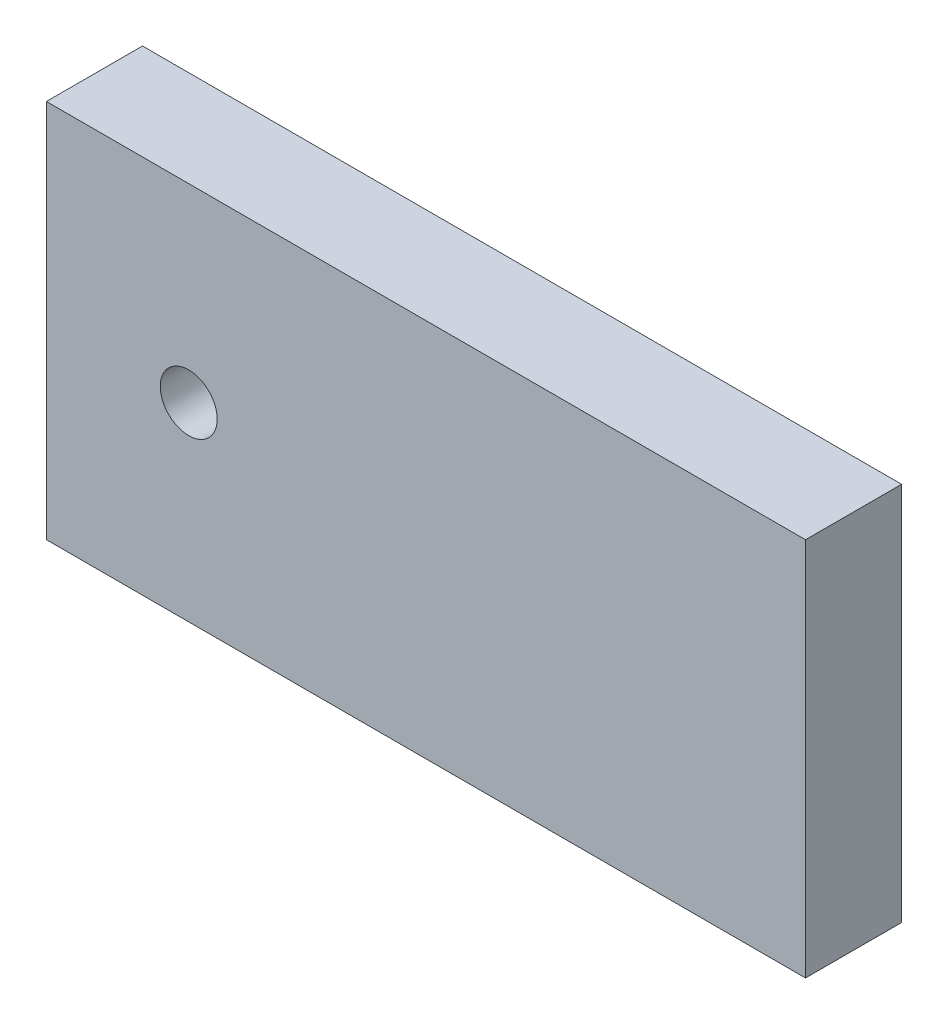
ISO-10303-21;
HEADER;
FILE_DESCRIPTION(('STEP AP214'),'2;1');
FILE_NAME('part.step','',(''),(''),'','','');
FILE_SCHEMA(('AUTOMOTIVE_DESIGN { 1 0 10303 214 1 1 1 1 }'));
ENDSEC;
DATA;
#1=APPLICATION_CONTEXT('core data for automotive mechanical design processes');
#2=APPLICATION_PROTOCOL_DEFINITION('international standard','automotive_design',2000,#1);
#3=PRODUCT_CONTEXT('',#1,'mechanical');
#4=PRODUCT('Part','Part','',(#3));
#5=PRODUCT_RELATED_PRODUCT_CATEGORY('part','',(#4));
#6=PRODUCT_DEFINITION_FORMATION('','',#4);
#7=PRODUCT_DEFINITION_CONTEXT('part definition',#1,'design');
#8=PRODUCT_DEFINITION('design','',#6,#7);
#9=PRODUCT_DEFINITION_SHAPE('','',#8);
#10=(LENGTH_UNIT() NAMED_UNIT(*) SI_UNIT(.MILLI.,.METRE.));
#11=(NAMED_UNIT(*) PLANE_ANGLE_UNIT() SI_UNIT($,.RADIAN.));
#12=(NAMED_UNIT(*) SI_UNIT($,.STERADIAN.) SOLID_ANGLE_UNIT());
#13=UNCERTAINTY_MEASURE_WITH_UNIT(LENGTH_MEASURE(1.E-05),#10,'distance_accuracy_value','');
#14=(GEOMETRIC_REPRESENTATION_CONTEXT(3) GLOBAL_UNCERTAINTY_ASSIGNED_CONTEXT((#13)) GLOBAL_UNIT_ASSIGNED_CONTEXT((#10,
#11,#12)) REPRESENTATION_CONTEXT('',''));
#15=CARTESIAN_POINT('',(0.,0.,0.));
#16=DIRECTION('',(0.,0.,1.));
#17=DIRECTION('',(1.,0.,0.));
#18=AXIS2_PLACEMENT_3D('',#15,#16,#17);
#19=CARTESIAN_POINT('',(0.,0.,10.125));
#20=DIRECTION('',(1.,0.,0.));
#21=DIRECTION('',(0.,1.,0.));
#22=AXIS2_PLACEMENT_3D('',#19,#20,#21);
#23=PLANE('',#22);
#24=DIRECTION('',(0.,-1.,0.));
#25=VECTOR('',#24,1.);
#26=CARTESIAN_POINT('',(0.,0.,0.));
#27=LINE('',#26,#25);
#28=CARTESIAN_POINT('',(0.,40.,0.));
#29=VERTEX_POINT('',#28);
#30=CARTESIAN_POINT('',(0.,0.,0.));
#31=VERTEX_POINT('',#30);
#32=EDGE_CURVE('E102',#29,#31,#27,.T.);
#33=ORIENTED_EDGE('',*,*,#32,.T.);
#34=DIRECTION('',(0.,0.,-1.));
#35=VECTOR('',#34,1.);
#36=CARTESIAN_POINT('',(0.,0.,10.125));
#37=LINE('',#36,#35);
#38=CARTESIAN_POINT('',(0.,0.,10.125));
#39=VERTEX_POINT('',#38);
#40=EDGE_CURVE('E11',#39,#31,#37,.T.);
#41=ORIENTED_EDGE('',*,*,#40,.F.);
#42=DIRECTION('',(0.,-1.,0.));
#43=VECTOR('',#42,1.);
#44=CARTESIAN_POINT('',(0.,0.,10.125));
#45=LINE('',#44,#43);
#46=CARTESIAN_POINT('',(0.,40.,10.125));
#47=VERTEX_POINT('',#46);
#48=EDGE_CURVE('E90',#47,#39,#45,.T.);
#49=ORIENTED_EDGE('',*,*,#48,.F.);
#50=DIRECTION('',(0.,0.,-1.));
#51=VECTOR('',#50,1.);
#52=CARTESIAN_POINT('',(0.,40.,10.125));
#53=LINE('',#52,#51);
#54=EDGE_CURVE('E98',#47,#29,#53,.T.);
#55=ORIENTED_EDGE('',*,*,#54,.T.);
#56=EDGE_LOOP('',(#33,#41,#49,#55));
#57=FACE_BOUND('',#56,.T.);
#58=ADVANCED_FACE('F39',(#57),#23,.F.);
#59=CARTESIAN_POINT('',(0.,0.,10.125));
#60=DIRECTION('',(0.,1.,0.));
#61=DIRECTION('',(0.,0.,1.));
#62=AXIS2_PLACEMENT_3D('',#59,#60,#61);
#63=PLANE('',#62);
#64=DIRECTION('',(1.,0.,0.));
#65=VECTOR('',#64,1.);
#66=CARTESIAN_POINT('',(0.,0.,0.));
#67=LINE('',#66,#65);
#68=CARTESIAN_POINT('',(80.,0.,0.));
#69=VERTEX_POINT('',#68);
#70=EDGE_CURVE('E94',#31,#69,#67,.T.);
#71=ORIENTED_EDGE('',*,*,#70,.T.);
#72=DIRECTION('',(0.,0.,-1.));
#73=VECTOR('',#72,1.);
#74=CARTESIAN_POINT('',(80.,0.,10.125));
#75=LINE('',#74,#73);
#76=CARTESIAN_POINT('',(80.,0.,10.125));
#77=VERTEX_POINT('',#76);
#78=EDGE_CURVE('E47',#77,#69,#75,.T.);
#79=ORIENTED_EDGE('',*,*,#78,.F.);
#80=DIRECTION('',(1.,0.,0.));
#81=VECTOR('',#80,1.);
#82=CARTESIAN_POINT('',(0.,0.,10.125));
#83=LINE('',#82,#81);
#84=EDGE_CURVE('E85',#39,#77,#83,.T.);
#85=ORIENTED_EDGE('',*,*,#84,.F.);
#86=ORIENTED_EDGE('',*,*,#40,.T.);
#87=EDGE_LOOP('',(#71,#79,#85,#86));
#88=FACE_BOUND('',#87,.T.);
#89=ADVANCED_FACE('F93',(#88),#63,.F.);
#90=CARTESIAN_POINT('',(80.,0.,10.125));
#91=DIRECTION('',(-1.,0.,0.));
#92=DIRECTION('',(0.,-1.,0.));
#93=AXIS2_PLACEMENT_3D('',#90,#91,#92);
#94=PLANE('',#93);
#95=DIRECTION('',(0.,1.,0.));
#96=VECTOR('',#95,1.);
#97=CARTESIAN_POINT('',(80.,0.,0.));
#98=LINE('',#97,#96);
#99=CARTESIAN_POINT('',(80.,40.,0.));
#100=VERTEX_POINT('',#99);
#101=EDGE_CURVE('E72',#69,#100,#98,.T.);
#102=ORIENTED_EDGE('',*,*,#101,.T.);
#103=DIRECTION('',(0.,0.,-1.));
#104=VECTOR('',#103,1.);
#105=CARTESIAN_POINT('',(80.,40.,10.125));
#106=LINE('',#105,#104);
#107=CARTESIAN_POINT('',(80.,40.,10.125));
#108=VERTEX_POINT('',#107);
#109=EDGE_CURVE('E95',#108,#100,#106,.T.);
#110=ORIENTED_EDGE('',*,*,#109,.F.);
#111=DIRECTION('',(0.,1.,0.));
#112=VECTOR('',#111,1.);
#113=CARTESIAN_POINT('',(80.,0.,10.125));
#114=LINE('',#113,#112);
#115=EDGE_CURVE('E88',#77,#108,#114,.T.);
#116=ORIENTED_EDGE('',*,*,#115,.F.);
#117=ORIENTED_EDGE('',*,*,#78,.T.);
#118=EDGE_LOOP('',(#102,#110,#116,#117));
#119=FACE_BOUND('',#118,.T.);
#120=ADVANCED_FACE('F96',(#119),#94,.F.);
#121=CARTESIAN_POINT('',(0.,40.,10.125));
#122=DIRECTION('',(0.,-1.,0.));
#123=DIRECTION('',(0.,0.,-1.));
#124=AXIS2_PLACEMENT_3D('',#121,#122,#123);
#125=PLANE('',#124);
#126=DIRECTION('',(-1.,0.,0.));
#127=VECTOR('',#126,1.);
#128=CARTESIAN_POINT('',(0.,40.,0.));
#129=LINE('',#128,#127);
#130=EDGE_CURVE('E78',#100,#29,#129,.T.);
#131=ORIENTED_EDGE('',*,*,#130,.T.);
#132=ORIENTED_EDGE('',*,*,#54,.F.);
#133=DIRECTION('',(-1.,0.,0.));
#134=VECTOR('',#133,1.);
#135=CARTESIAN_POINT('',(0.,40.,10.125));
#136=LINE('',#135,#134);
#137=EDGE_CURVE('E55',#108,#47,#136,.T.);
#138=ORIENTED_EDGE('',*,*,#137,.F.);
#139=ORIENTED_EDGE('',*,*,#109,.T.);
#140=EDGE_LOOP('',(#131,#132,#138,#139));
#141=FACE_BOUND('',#140,.T.);
#142=ADVANCED_FACE('F110',(#141),#125,.F.);
#143=CARTESIAN_POINT('',(0.,0.,10.125));
#144=DIRECTION('',(0.,0.,-1.));
#145=DIRECTION('',(-1.,0.,0.));
#146=AXIS2_PLACEMENT_3D('',#143,#144,#145);
#147=PLANE('',#146);
#148=CARTESIAN_POINT('',(15.,20.,10.125));
#149=DIRECTION('',(0.,0.,1.));
#150=DIRECTION('',(1.,0.,0.));
#151=AXIS2_PLACEMENT_3D('',#148,#149,#150);
#152=CIRCLE('',#151,3.);
#153=CARTESIAN_POINT('',(18.,20.,10.125));
#154=VERTEX_POINT('',#153);
#155=EDGE_CURVE('E116',#154,#154,#152,.T.);
#156=ORIENTED_EDGE('',*,*,#155,.F.);
#157=EDGE_LOOP('',(#156));
#158=FACE_BOUND('',#157,.T.);
#159=ORIENTED_EDGE('',*,*,#48,.T.);
#160=ORIENTED_EDGE('',*,*,#84,.T.);
#161=ORIENTED_EDGE('',*,*,#115,.T.);
#162=ORIENTED_EDGE('',*,*,#137,.T.);
#163=EDGE_LOOP('',(#159,#160,#161,#162));
#164=FACE_BOUND('',#163,.T.);
#165=ADVANCED_FACE('F86',(#158,#164),#147,.F.);
#166=CARTESIAN_POINT('',(0.,0.,0.));
#167=DIRECTION('',(0.,0.,-1.));
#168=DIRECTION('',(-1.,0.,0.));
#169=AXIS2_PLACEMENT_3D('',#166,#167,#168);
#170=PLANE('',#169);
#171=CARTESIAN_POINT('',(15.,20.,0.));
#172=DIRECTION('',(0.,0.,1.));
#173=DIRECTION('',(1.,0.,0.));
#174=AXIS2_PLACEMENT_3D('',#171,#172,#173);
#175=CIRCLE('',#174,3.);
#176=CARTESIAN_POINT('',(18.,20.,0.));
#177=VERTEX_POINT('',#176);
#178=EDGE_CURVE('E105',#177,#177,#175,.T.);
#179=ORIENTED_EDGE('',*,*,#178,.T.);
#180=EDGE_LOOP('',(#179));
#181=FACE_BOUND('',#180,.T.);
#182=ORIENTED_EDGE('',*,*,#32,.F.);
#183=ORIENTED_EDGE('',*,*,#130,.F.);
#184=ORIENTED_EDGE('',*,*,#101,.F.);
#185=ORIENTED_EDGE('',*,*,#70,.F.);
#186=EDGE_LOOP('',(#182,#183,#184,#185));
#187=FACE_BOUND('',#186,.T.);
#188=ADVANCED_FACE('F113',(#181,#187),#170,.T.);
#189=CARTESIAN_POINT('',(15.,20.,0.));
#190=DIRECTION('',(0.,0.,1.));
#191=DIRECTION('',(1.,0.,0.));
#192=AXIS2_PLACEMENT_3D('',#189,#190,#191);
#193=CYLINDRICAL_SURFACE('',#192,3.);
#194=ORIENTED_EDGE('',*,*,#178,.F.);
#195=EDGE_LOOP('',(#194));
#196=FACE_BOUND('',#195,.T.);
#197=ORIENTED_EDGE('',*,*,#155,.T.);
#198=EDGE_LOOP('',(#197));
#199=FACE_BOUND('',#198,.T.);
#200=ADVANCED_FACE('F123',(#196,#199),#193,.F.);
#201=CLOSED_SHELL('',(#58,#89,#120,#142,#165,#188,#200));
#202=MANIFOLD_SOLID_BREP('B2',#201);
#203=ADVANCED_BREP_SHAPE_REPRESENTATION('',(#18,#202),#14);
#204=SHAPE_DEFINITION_REPRESENTATION(#9,#203);
ENDSEC;
END-ISO-10303-21;
